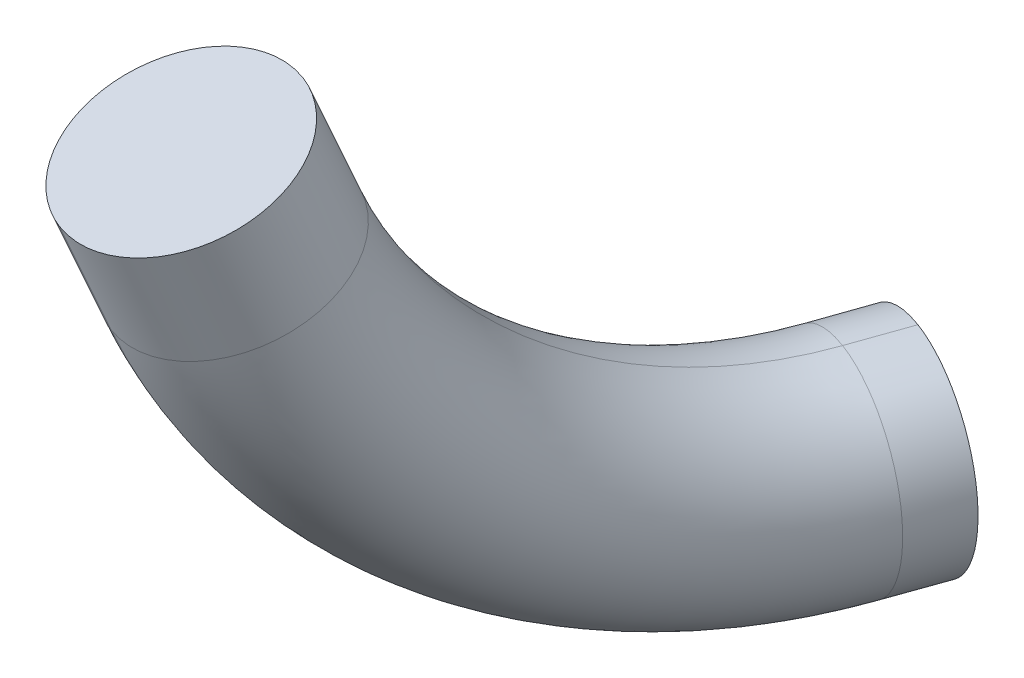
ISO-10303-21;
HEADER;
FILE_DESCRIPTION(('STEP AP214'),'2;1');
FILE_NAME('part.step','',(''),(''),'','','');
FILE_SCHEMA(('AUTOMOTIVE_DESIGN { 1 0 10303 214 1 1 1 1 }'));
ENDSEC;
DATA;
#1=APPLICATION_CONTEXT('core data for automotive mechanical design processes');
#2=APPLICATION_PROTOCOL_DEFINITION('international standard','automotive_design',2000,#1);
#3=PRODUCT_CONTEXT('',#1,'mechanical');
#4=PRODUCT('Part','Part','',(#3));
#5=PRODUCT_RELATED_PRODUCT_CATEGORY('part','',(#4));
#6=PRODUCT_DEFINITION_FORMATION('','',#4);
#7=PRODUCT_DEFINITION_CONTEXT('part definition',#1,'design');
#8=PRODUCT_DEFINITION('design','',#6,#7);
#9=PRODUCT_DEFINITION_SHAPE('','',#8);
#10=(LENGTH_UNIT() NAMED_UNIT(*) SI_UNIT(.MILLI.,.METRE.));
#11=(NAMED_UNIT(*) PLANE_ANGLE_UNIT() SI_UNIT($,.RADIAN.));
#12=(NAMED_UNIT(*) SI_UNIT($,.STERADIAN.) SOLID_ANGLE_UNIT());
#13=UNCERTAINTY_MEASURE_WITH_UNIT(LENGTH_MEASURE(1.E-05),#10,'distance_accuracy_value','');
#14=(GEOMETRIC_REPRESENTATION_CONTEXT(3) GLOBAL_UNCERTAINTY_ASSIGNED_CONTEXT((#13)) GLOBAL_UNIT_ASSIGNED_CONTEXT((#10,
#11,#12)) REPRESENTATION_CONTEXT('',''));
#15=CARTESIAN_POINT('',(0.,0.,0.));
#16=DIRECTION('',(0.,0.,1.));
#17=DIRECTION('',(1.,0.,0.));
#18=AXIS2_PLACEMENT_3D('',#15,#16,#17);
#19=CARTESIAN_POINT('',(165.398911899478,87.6537059481545,-187.091780518201));
#20=DIRECTION('',(-0.127160650574255,0.931699085420016,0.340245474875182));
#21=DIRECTION('',(-0.991871748779087,-0.117874078311736,-0.0479180095170463));
#22=AXIS2_PLACEMENT_3D('',#19,#20,#21);
#23=CIRCLE('',#22,3.);
#24=DIRECTION('',(-0.129094724066351,0.929456224938322,0.345609140709032));
#25=VECTOR('',#24,1.);
#26=SURFACE_OF_LINEAR_EXTRUSION('',#23,#25);
#27=DIRECTION('',(-0.129094724066351,0.929456224938322,0.345609140709032));
#28=VECTOR('',#27,1.);
#29=CARTESIAN_POINT('',(166.186074523711,90.2436129313881,-189.145738097375));
#30=LINE('',#29,#28);
#31=CARTESIAN_POINT('',(166.394446109492,88.7433791435449,-189.703585251367));
#32=VERTEX_POINT('',#31);
#33=CARTESIAN_POINT('',(165.977702938679,91.7438467192157,-188.587890942761));
#34=VERTEX_POINT('',#33);
#35=EDGE_CURVE('E66',#32,#34,#30,.T.);
#36=ORIENTED_EDGE('',*,*,#35,.F.);
#37=CARTESIAN_POINT('',(165.398911903139,87.6537059217969,-187.091780528002));
#38=DIRECTION('',(-0.127160650574255,0.931699085420016,0.340245474875182));
#39=DIRECTION('',(-0.991871748779087,-0.117874078311736,-0.0479180095170463));
#40=AXIS2_PLACEMENT_3D('',#37,#38,#39);
#41=CIRCLE('',#40,3.);
#42=CARTESIAN_POINT('',(164.403377690466,86.5640327528471,-184.479975785037));
#43=VERTEX_POINT('',#42);
#44=EDGE_CURVE('E11',#32,#43,#41,.T.);
#45=ORIENTED_EDGE('',*,*,#44,.T.);
#46=DIRECTION('',(-0.129094724066351,0.929456224938322,0.345609140709032));
#47=VECTOR('',#46,1.);
#48=CARTESIAN_POINT('',(164.195006104686,88.0642665406853,-183.922128630046));
#49=LINE('',#48,#47);
#50=CARTESIAN_POINT('',(163.9866345197,89.5645003283934,-183.364281475804));
#51=VERTEX_POINT('',#50);
#52=EDGE_CURVE('E33',#43,#51,#49,.T.);
#53=ORIENTED_EDGE('',*,*,#52,.T.);
#54=CARTESIAN_POINT('',(165.977702938756,91.7438467191743,-188.587890942618));
#55=CARTESIAN_POINT('',(165.898835809901,91.7440354890763,-188.617883030428));
#56=CARTESIAN_POINT('',(165.818785611349,91.7429253854309,-188.644760545195));
#57=CARTESIAN_POINT('',(165.656896904855,91.738128840954,-188.692129102094));
#58=CARTESIAN_POINT('',(165.575058482722,91.7344425234818,-188.712620449952));
#59=CARTESIAN_POINT('',(165.410221450707,91.7245184643876,-188.74705014355));
#60=CARTESIAN_POINT('',(165.327223696779,91.7182825180335,-188.7609930854));
#61=CARTESIAN_POINT('',(165.16063157154,91.703310050774,-188.782254584841));
#62=CARTESIAN_POINT('',(165.077037207491,91.6945735602549,-188.789573222925));
#63=CARTESIAN_POINT('',(164.826155733128,91.6646838787261,-188.801488333787));
#64=CARTESIAN_POINT('',(164.658700419232,91.6398462521338,-188.796058526605));
#65=CARTESIAN_POINT('',(164.328559739514,91.5810910610425,-188.75855250483));
#66=CARTESIAN_POINT('',(164.165873443561,91.5471752803594,-188.726481522505));
#67=CARTESIAN_POINT('',(163.849734560601,91.4712134148597,-188.636625295629));
#68=CARTESIAN_POINT('',(163.696282177256,91.4291671508048,-188.578839484152));
#69=CARTESIAN_POINT('',(163.402979019557,91.3381338575216,-188.439178506255));
#70=CARTESIAN_POINT('',(163.263130320167,91.2891457722512,-188.357299672578));
#71=CARTESIAN_POINT('',(163.001029088139,91.1856261541123,-188.171786050728));
#72=CARTESIAN_POINT('',(162.878775778992,91.1310948660547,-188.068152223131));
#73=CARTESIAN_POINT('',(162.655338085377,91.0180387530076,-187.842074875086));
#74=CARTESIAN_POINT('',(162.554152353403,90.959514183751,-187.719632558521));
#75=CARTESIAN_POINT('',(162.375709233757,90.8401290439526,-187.459408429425));
#76=CARTESIAN_POINT('',(162.298452336466,90.7792684255662,-187.321626302609));
#77=CARTESIAN_POINT('',(162.17006316232,90.6569359326122,-187.034624628518));
#78=CARTESIAN_POINT('',(162.118931486386,90.5954640440176,-186.885404818248));
#79=CARTESIAN_POINT('',(162.044240849874,90.4736657648104,-186.579797122949));
#80=CARTESIAN_POINT('',(162.020681615949,90.4133393628476,-186.423409308998));
#81=CARTESIAN_POINT('',(162.001827752839,90.2955078289811,-186.107795815894));
#82=CARTESIAN_POINT('',(162.006533033986,90.2380026881278,-185.948570145747));
#83=CARTESIAN_POINT('',(162.03463158546,90.1551581340011,-185.71121437951));
#84=CARTESIAN_POINT('',(162.047516610787,90.1280990821073,-185.632302640522));
#85=CARTESIAN_POINT('',(162.080206071892,90.0752903182222,-185.475478541174));
#86=CARTESIAN_POINT('',(162.100008905013,90.049540304546,-185.397565953668));
#87=CARTESIAN_POINT('',(162.146390678545,89.9995453058122,-185.243329571502));
#88=CARTESIAN_POINT('',(162.172966797469,89.9752996992936,-185.167005129567));
#89=CARTESIAN_POINT('',(162.232723046818,89.9284543622964,-185.016395040782));
#90=CARTESIAN_POINT('',(162.265909525735,89.9058562427615,-184.942111432568));
#91=CARTESIAN_POINT('',(162.374987607971,89.840837230732,-184.723302956215));
#92=CARTESIAN_POINT('',(162.460460440994,89.8011244989978,-184.582613070751));
#93=CARTESIAN_POINT('',(162.65449606098,89.7301629744497,-184.315780769082));
#94=CARTESIAN_POINT('',(162.763057969495,89.6989138597306,-184.189637799703));
#95=CARTESIAN_POINT('',(162.94081140956,89.6590386394156,-184.014014745787));
#96=CARTESIAN_POINT('',(163.002619672815,89.6469043484192,-183.957687510878));
#97=CARTESIAN_POINT('',(163.130752276555,89.6250615949784,-183.849987919374));
#98=CARTESIAN_POINT('',(163.197072903783,89.6153511679209,-183.798611570813));
#99=CARTESIAN_POINT('',(163.333717733639,89.5984265006436,-183.70119795349));
#100=CARTESIAN_POINT('',(163.404037939242,89.5912098175972,-183.655155489317));
#101=CARTESIAN_POINT('',(163.548234347342,89.5793106405462,-183.568680977199));
#102=CARTESIAN_POINT('',(163.622109501326,89.5746274042428,-183.52824728847));
#103=CARTESIAN_POINT('',(163.74462629466,89.5691006963649,-183.467324968108));
#104=CARTESIAN_POINT('',(163.792350048025,89.5674759829206,-183.445040094052));
#105=CARTESIAN_POINT('',(163.888773517758,89.5652344464392,-183.402865518074));
#106=CARTESIAN_POINT('',(163.937471490282,89.5646159616431,-183.382971917463));
#107=CARTESIAN_POINT('',(163.986634519792,89.564500328459,-183.364281475949));
#108=B_SPLINE_CURVE_WITH_KNOTS('',3,(#54,#55,#56,#57,#58,#59,#60,#61,#62,#63,#64,#65,#66,#67,
#68,#69,#70,#71,#72,#73,#74,#75,#76,#77,#78,#79,#80,#81,#82,#83,#84,#85,#86,#87,#88,#89,#90,#91,
#92,#93,#94,#95,#96,#97,#98,#99,#100,#101,#102,#103,#104,#105,#106,#107),.UNSPECIFIED.,.F.,.F.,
(4,2,2,2,2,2,2,2,2,2,2,2,2,2,2,2,2,2,2,2,2,2,2,2,2,2,4),(0.,0.253050577476994,0.506089038735203,
0.758949634262865,1.01180715718079,1.51731058010417,2.02271474672494,2.52813005635787,
3.03362233628287,3.53909230125485,4.0445299258578,4.54997790785142,5.05543751543637,
5.56089211198525,6.0663451050151,6.31933241962662,6.57226116319433,6.82508471821394,
7.07815226220611,7.5836156707436,8.08905985178373,8.34230891304529,8.59535203706144,
8.84814657720097,9.10086700847022,9.2588863367272,9.41664443452902),.UNSPECIFIED.);
#109=EDGE_CURVE('E62',#34,#51,#108,.T.);
#110=ORIENTED_EDGE('',*,*,#109,.F.);
#111=EDGE_LOOP('',(#36,#45,#53,#110));
#112=FACE_BOUND('',#111,.T.);
#113=ADVANCED_FACE('F17',(#112),#26,.T.);
#114=CARTESIAN_POINT('',(166.394446109492,88.7433791435449,-189.703585251367));
#115=CARTESIAN_POINT('',(165.513489350697,88.7454548631521,-190.03851102979));
#116=CARTESIAN_POINT('',(164.509713481903,88.6130975407388,-190.051218315672));
#117=CARTESIAN_POINT('',(163.566202946162,88.3441598968496,-189.667402649562));
#118=CARTESIAN_POINT('',(162.248788534349,87.6611283021772,-188.289407428937));
#119=CARTESIAN_POINT('',(162.31517776306,86.9748361747137,-186.385312024443));
#120=CARTESIAN_POINT('',(162.764283282873,86.702617234187,-185.472045835423));
#121=CARTESIAN_POINT('',(163.52242093167,86.5661084724543,-184.81490156346));
#122=CARTESIAN_POINT('',(164.403377690466,86.5640327528471,-184.479975785037));
#123=B_SPLINE_CURVE_WITH_KNOTS('',5,(#114,#115,#116,#117,#118,#119,#120,#121,#122),
.UNSPECIFIED.,.F.,.F.,(6,3,6),(0.,0.49999999999947,1.),.UNSPECIFIED.);
#124=CARTESIAN_POINT('',(170.127972015936,93.1873805483324,-200.207207915746));
#125=DIRECTION('',(0.940180277421394,0.00391507184373613,0.340654837277103));
#126=AXIS1_PLACEMENT('',#124,#125);
#127=SURFACE_OF_REVOLUTION('',#123,#126);
#128=CARTESIAN_POINT('',(170.253603816736,81.1875885257562,-200.267716763884));
#129=CARTESIAN_POINT('',(170.207456480243,81.1882242325414,-200.284436723732));
#130=CARTESIAN_POINT('',(170.161294718661,81.1876529623984,-200.301162742752));
#131=CARTESIAN_POINT('',(170.069055342379,81.1841005428846,-200.334585954502));
#132=CARTESIAN_POINT('',(170.022977724869,81.1811194755101,-200.351283148194));
#133=CARTESIAN_POINT('',(169.931018816667,81.1727517916469,-200.38460806055));
#134=CARTESIAN_POINT('',(169.885137516109,81.1673652974999,-200.401235782704));
#135=CARTESIAN_POINT('',(169.79368242844,81.1541994630716,-200.43438145737));
#136=CARTESIAN_POINT('',(169.74810862497,81.1464202511146,-200.45089941572));
#137=CARTESIAN_POINT('',(169.657378510995,81.1284876274055,-200.483785701433));
#138=CARTESIAN_POINT('',(169.612222181104,81.1183343264686,-200.500154035743));
#139=CARTESIAN_POINT('',(169.522435607755,81.0956785096661,-200.532701709859));
#140=CARTESIAN_POINT('',(169.4778053466,81.0831760730608,-200.548881056022));
#141=CARTESIAN_POINT('',(169.38917793211,81.0558529483939,-200.581011955812));
#142=CARTESIAN_POINT('',(169.345180767419,81.0410323019625,-200.596963513524));
#143=CARTESIAN_POINT('',(169.25792481281,81.009109544131,-200.628600670041));
#144=CARTESIAN_POINT('',(169.214666021515,80.9920074369847,-200.644286269341));
#145=CARTESIAN_POINT('',(169.1289901442,80.9555641590765,-200.675354040414));
#146=CARTESIAN_POINT('',(169.086573068788,80.9362229601157,-200.690736208363));
#147=CARTESIAN_POINT('',(169.002681836037,80.8953493229607,-200.721160411676));
#148=CARTESIAN_POINT('',(168.961207701389,80.8738168321023,-200.736202438855));
#149=CARTESIAN_POINT('',(168.87930126421,80.8286136645213,-200.765910484862));
#150=CARTESIAN_POINT('',(168.838868994649,80.8049429202425,-200.780576491791));
#151=CARTESIAN_POINT('',(168.75914272186,80.7555213367311,-200.809497516563));
#152=CARTESIAN_POINT('',(168.719848758417,80.7297704249156,-200.823752520041));
#153=CARTESIAN_POINT('',(168.642492870885,80.6762514444123,-200.851817518057));
#154=CARTESIAN_POINT('',(168.604430988712,80.6484833072022,-200.865627497454));
#155=CARTESIAN_POINT('',(168.52963019369,80.5909974719874,-200.89276945435));
#156=CARTESIAN_POINT('',(168.492891319548,80.561279717014,-200.906101417864));
#157=CARTESIAN_POINT('',(168.420824445043,80.4999667120047,-200.932255443177));
#158=CARTESIAN_POINT('',(168.385496474815,80.4683714219015,-200.945077494086));
#159=CARTESIAN_POINT('',(168.316336103928,80.4033796942659,-200.970180954003));
#160=CARTESIAN_POINT('',(168.282503720092,80.3699832364801,-200.982462356929));
#161=CARTESIAN_POINT('',(168.216415825265,80.3014696155723,-201.006455007071));
#162=CARTESIAN_POINT('',(168.184160314273,80.2663524524502,-201.018166254285));
#163=CARTESIAN_POINT('',(168.121303891397,80.1944817700333,-201.04099037254));
#164=CARTESIAN_POINT('',(168.090702960908,80.1577282691469,-201.052103250309));
#165=CARTESIAN_POINT('',(168.031229663238,80.0826729798711,-201.07370376974));
#166=CARTESIAN_POINT('',(168.002357259169,80.0443712245507,-201.084191424744));
#167=CARTESIAN_POINT('',(167.946411031001,79.9663110266403,-201.104516066576));
#168=CARTESIAN_POINT('',(167.919337154349,79.9265526266657,-201.114353072414));
#169=CARTESIAN_POINT('',(167.867053864436,79.8456740827669,-201.133352479117));
#170=CARTESIAN_POINT('',(167.841844387846,79.8045539851652,-201.142514902896));
#171=CARTESIAN_POINT('',(167.793351462515,79.7210501432959,-201.160142771384));
#172=CARTESIAN_POINT('',(167.770067946574,79.6786664431881,-201.168608240411));
#173=CARTESIAN_POINT('',(167.725484002527,79.592736457729,-201.184821455344));
#174=CARTESIAN_POINT('',(167.704183511772,79.5491902091625,-201.192569223923));
#175=CARTESIAN_POINT('',(167.663617988571,79.4610389618227,-201.207327991129));
#176=CARTESIAN_POINT('',(167.644352907208,79.4164339885255,-201.214339007461));
#177=CARTESIAN_POINT('',(167.607905699437,79.3262717092122,-201.227606987478));
#178=CARTESIAN_POINT('',(167.590723546797,79.280714415198,-201.233863960658));
#179=CARTESIAN_POINT('',(167.558484635924,79.1887563027303,-201.245608402378));
#180=CARTESIAN_POINT('',(167.543427881654,79.1423554827042,-201.251095869483));
#181=CARTESIAN_POINT('',(167.515476967614,79.0488213252622,-201.261287743906));
#182=CARTESIAN_POINT('',(167.502582846679,79.0016879747082,-201.265992137161));
#183=CARTESIAN_POINT('',(167.478988979214,78.9068017701094,-201.274606271227));
#184=CARTESIAN_POINT('',(167.468289306726,78.8590488952194,-201.278515985224));
#185=CARTESIAN_POINT('',(167.44911051656,78.7630384703825,-201.285531195713));
#186=CARTESIAN_POINT('',(167.440631502537,78.7147808969867,-201.288636654664));
#187=CARTESIAN_POINT('',(167.425914432373,78.6178775287129,-201.294035882157));
#188=CARTESIAN_POINT('',(167.419676496425,78.5692317131554,-201.296329607165));
#189=CARTESIAN_POINT('',(167.409456032063,78.4716697420713,-201.300100049967));
#190=CARTESIAN_POINT('',(167.40547361837,78.4227535729217,-201.301576726204));
#191=CARTESIAN_POINT('',(167.399772519233,78.3247700408842,-201.303709974462));
#192=CARTESIAN_POINT('',(167.398053910819,78.2757026729084,-201.304366518576));
#193=CARTESIAN_POINT('',(167.396882441863,78.177536782708,-201.304858688021));
#194=CARTESIAN_POINT('',(167.39742958132,78.1284382604834,-201.304694313353));
#195=CARTESIAN_POINT('',(167.400790607927,78.030330123355,-201.303544200151));
#196=CARTESIAN_POINT('',(167.403604417951,77.9813205054829,-201.302558489566));
#197=CARTESIAN_POINT('',(167.41149338668,77.8835095279723,-201.299767578407));
#198=CARTESIAN_POINT('',(167.416568430377,77.8347081578696,-201.29796241951));
#199=CARTESIAN_POINT('',(167.428968245853,77.737431929842,-201.293536740608));
#200=CARTESIAN_POINT('',(167.436292896983,77.6889570545493,-201.290916264328));
#201=CARTESIAN_POINT('',(167.453174276971,77.5924507989488,-201.284866265151));
#202=CARTESIAN_POINT('',(167.462730901648,77.5444193980497,-201.281436780016));
#203=CARTESIAN_POINT('',(167.484052737757,77.448915598264,-201.273777194852));
#204=CARTESIAN_POINT('',(167.495817874675,77.4014431805746,-201.269547121835));
#205=CARTESIAN_POINT('',(167.521527591906,77.3071711843622,-201.260296841789));
#206=CARTESIAN_POINT('',(167.535472133082,77.2603715937731,-201.25527664895));
#207=CARTESIAN_POINT('',(167.565506049655,77.1675572240229,-201.244458591839));
#208=CARTESIAN_POINT('',(167.581595421052,77.1215424433987,-201.238660729018));
#209=CARTESIAN_POINT('',(167.615879108036,77.0304076075777,-201.226301709336));
#210=CARTESIAN_POINT('',(167.634073450133,76.9852875636577,-201.219740542862));
#211=CARTESIAN_POINT('',(167.67252209092,76.8960498640754,-201.205871141802));
#212=CARTESIAN_POINT('',(167.692776439121,76.8519322325359,-201.198562889261));
#213=CARTESIAN_POINT('',(167.735295188666,76.7648045767879,-201.183217324822));
#214=CARTESIAN_POINT('',(167.757559653519,76.7217945876296,-201.17517998989));
#215=CARTESIAN_POINT('',(167.804043997307,76.6369847993142,-201.158395987084));
#216=CARTESIAN_POINT('',(167.828263944474,76.5951850424546,-201.149649294458));
#217=CARTESIAN_POINT('',(167.878600057186,76.5128954720522,-201.131467955621));
#218=CARTESIAN_POINT('',(167.904716287144,76.4724057030754,-201.122033286039));
#219=CARTESIAN_POINT('',(167.958781391011,76.3928328389341,-201.102498961258));
#220=CARTESIAN_POINT('',(167.986730318472,76.3537497849259,-201.092399286627));
#221=CARTESIAN_POINT('',(168.044393041308,76.2770838642798,-201.071559444288));
#222=CARTESIAN_POINT('',(168.074106874346,76.2395010296857,-201.060819262911));
#223=CARTESIAN_POINT('',(168.135227607262,76.1659256496424,-201.038724360355));
#224=CARTESIAN_POINT('',(168.166634526177,76.1299331220839,-201.027369632264));
#225=CARTESIAN_POINT('',(168.231065781001,76.0596248505163,-201.004072986551));
#226=CARTESIAN_POINT('',(168.264090116911,76.0253091065073,-200.992131068928));
#227=CARTESIAN_POINT('',(168.33167688334,75.9584370927937,-200.967688727704));
#228=CARTESIAN_POINT('',(168.366239296556,75.9258808033049,-200.955188310386));
#229=CARTESIAN_POINT('',(168.436819399058,75.862606388865,-200.929658922834));
#230=CARTESIAN_POINT('',(168.472837057262,75.8318882246882,-200.916629963889));
#231=CARTESIAN_POINT('',(168.546241511791,75.7723645532707,-200.890074651751));
#232=CARTESIAN_POINT('',(168.583628268063,75.7435589901443,-200.876548313109));
#233=CARTESIAN_POINT('',(168.659681638622,75.6879306178299,-200.849030541764));
#234=CARTESIAN_POINT('',(168.698348209371,75.6611077412946,-200.835039124882));
#235=CARTESIAN_POINT('',(168.776868964471,75.6095102461813,-200.806624574457));
#236=CARTESIAN_POINT('',(168.816723107318,75.5847355561381,-200.792201456002));
#237=CARTESIAN_POINT('',(168.897523976408,75.5372951477073,-200.762957892503));
#238=CARTESIAN_POINT('',(168.938470668081,75.5146293626922,-200.748137460031));
#239=CARTESIAN_POINT('',(169.021358997999,75.4714624907787,-200.718134606458));
#240=CARTESIAN_POINT('',(169.063300612303,75.4509613518573,-200.702952194066));
#241=CARTESIAN_POINT('',(169.148078723814,75.4121743154859,-200.672261601498));
#242=CARTESIAN_POINT('',(169.190915209742,75.3938883901379,-200.656753425427));
#243=CARTESIAN_POINT('',(169.277380754225,75.3595769452708,-200.625448344059));
#244=CARTESIAN_POINT('',(169.321009814257,75.3435514299664,-200.609651438223));
#245=CARTESIAN_POINT('',(169.408956130644,75.3138003998107,-200.577806688304));
#246=CARTESIAN_POINT('',(169.453273399342,75.3000749262639,-200.561758839719));
#247=CARTESIAN_POINT('',(169.542489871207,75.2749578006753,-200.529450682448));
#248=CARTESIAN_POINT('',(169.587389093954,75.2635662273812,-200.513190366612));
#249=CARTESIAN_POINT('',(169.677661507414,75.2431448018215,-200.480496374705));
#250=CARTESIAN_POINT('',(169.723034720149,75.2341150598018,-200.46406269058));
#251=CARTESIAN_POINT('',(169.814145620333,75.2184389258008,-200.431061619471));
#252=CARTESIAN_POINT('',(169.859883327196,75.2117926616519,-200.414494225365));
#253=CARTESIAN_POINT('',(169.951612381887,75.2008992509608,-200.381265881411));
#254=CARTESIAN_POINT('',(169.997603742497,75.1966522264491,-200.364604926848));
#255=CARTESIAN_POINT('',(170.089728080921,75.1905647884653,-200.331230045979));
#256=CARTESIAN_POINT('',(170.135861063499,75.1887244568856,-200.314516117888));
#257=CARTESIAN_POINT('',(170.182008428068,75.1880911028296,-200.297796146244));
#258=B_SPLINE_CURVE_WITH_KNOTS('',3,(#128,#129,#130,#131,#132,#133,#134,#135,#136,#137,#138,
#139,#140,#141,#142,#143,#144,#145,#146,#147,#148,#149,#150,#151,#152,#153,#154,#155,#156,#157,
#158,#159,#160,#161,#162,#163,#164,#165,#166,#167,#168,#169,#170,#171,#172,#173,#174,#175,#176,
#177,#178,#179,#180,#181,#182,#183,#184,#185,#186,#187,#188,#189,#190,#191,#192,#193,#194,#195,
#196,#197,#198,#199,#200,#201,#202,#203,#204,#205,#206,#207,#208,#209,#210,#211,#212,#213,#214,
#215,#216,#217,#218,#219,#220,#221,#222,#223,#224,#225,#226,#227,#228,#229,#230,#231,#232,#233,
#234,#235,#236,#237,#238,#239,#240,#241,#242,#243,#244,#245,#246,#247,#248,#249,#250,#251,#252,
#253,#254,#255,#256,#257),.UNSPECIFIED.,.F.,.F.,(4,2,2,2,2,2,2,2,2,2,2,2,2,2,2,2,2,2,2,2,2,2,2,
2,2,2,2,2,2,2,2,2,2,2,2,2,2,2,2,2,2,2,2,2,2,2,2,2,2,2,2,2,2,2,2,2,2,2,2,2,2,2,2,2,4),(0.,
0.14724635201027,0.294487693996522,0.441721548038776,0.58894750714245,0.736166595572781,
0.883380717701729,1.03059219646958,1.17780340075594,1.32501645921944,1.47223305656237,
1.6194543067021,1.76668069602605,1.91391208876866,2.06114778558397,2.20838662559836,
2.35562712160683,2.50286761761431,2.65010645762584,2.79734215443588,2.94457354717059,
3.09179993648323,3.23902118660741,3.38623778392984,3.53345084236736,3.68066204662176,
3.82787352535143,3.97508764743596,4.12230673581676,4.26953269486701,4.41676654885436,
4.56400789078721,4.71125424274999,4.85850059471686,5.00574193666081,5.15297579066417,
5.30020174973343,5.44742083813475,5.59463496023951,5.74184643898785,5.88905764325827,
6.03627070170829,6.18348729903915,6.330708549167,6.47793493847842,6.6251663312069,
6.77240202800593,6.91964086800191,7.06688136398968,7.2141218599747,7.3613606999626,
7.50859639674886,7.65582778946077,7.80305417875289,7.95027542886034,8.09749202617124,
8.24470508460357,8.39191628886027,8.53912776760059,8.68634188970447,8.83356097811293,
8.98078693719847,9.1280207912269,9.27526213320425,9.42250848521117),.UNSPECIFIED.);
#259=CARTESIAN_POINT('',(170.253603816732,81.18758852528,-200.26771676389));
#260=VERTEX_POINT('',#259);
#261=CARTESIAN_POINT('',(170.182008428132,75.1880911020489,-200.297796146452));
#262=VERTEX_POINT('',#261);
#263=EDGE_CURVE('E165',#260,#262,#258,.T.);
#264=ORIENTED_EDGE('',*,*,#263,.T.);
#265=CARTESIAN_POINT('',(170.080470478322,93.1871827437726,-200.224419114187));
#266=DIRECTION('',(-0.940180277421394,-0.00391507184373613,-0.340654837277103));
#267=DIRECTION('',(-0.340260237895466,0.0602565524829503,0.938398699056105));
#268=AXIS2_PLACEMENT_3D('',#265,#266,#267);
#269=CIRCLE('',#268,17.9995276069);
#270=EDGE_CURVE('E138',#262,#43,#269,.T.);
#271=ORIENTED_EDGE('',*,*,#270,.T.);
#272=ORIENTED_EDGE('',*,*,#44,.F.);
#273=CARTESIAN_POINT('',(170.175473554549,93.1875783528804,-200.189996718308));
#274=DIRECTION('',(-0.940180277421394,-0.00391507184373613,-0.340654837277103));
#275=DIRECTION('',(-0.340260237895466,0.0602565524829507,0.938398699056105));
#276=AXIS2_PLACEMENT_3D('',#273,#274,#275);
#277=CIRCLE('',#276,12.0004958484);
#278=EDGE_CURVE('E41',#260,#32,#277,.T.);
#279=ORIENTED_EDGE('',*,*,#278,.F.);
#280=EDGE_LOOP('',(#264,#271,#272,#279));
#281=FACE_BOUND('',#280,.T.);
#282=ADVANCED_FACE('F92',(#281),#127,.T.);
#283=CARTESIAN_POINT('',(170.810802691754,78.1996352459061,-201.919515420524));
#284=DIRECTION('',(-0.340654989152248,-0.000648546411300685,0.940188150187628));
#285=DIRECTION('',(-0.940035212875449,0.0182843925228757,-0.340586963262364));
#286=AXIS2_PLACEMENT_3D('',#283,#284,#285);
#287=CIRCLE('',#286,3.);
#288=DIRECTION('',(-0.340624688683062,-0.00677544464166594,0.940174938407462));
#289=VECTOR('',#288,1.);
#290=SURFACE_OF_LINEAR_EXTRUSION('',#287,#289);
#291=DIRECTION('',(-0.340624688683062,-0.00677544464166594,0.940174938407462));
#292=VECTOR('',#291,1.);
#293=CARTESIAN_POINT('',(170.550102102392,81.1934862413614,-201.086096247068));
#294=LINE('',#293,#292);
#295=CARTESIAN_POINT('',(170.846600387027,81.1993839574866,-201.904475729564));
#296=VERTEX_POINT('',#295);
#297=EDGE_CURVE('E70',#296,#260,#294,.T.);
#298=ORIENTED_EDGE('',*,*,#297,.F.);
#299=CARTESIAN_POINT('',(170.84660038707,81.1993839575026,-201.904475729548));
#300=CARTESIAN_POINT('',(170.767276003678,81.2004827591684,-201.933216289972));
#301=CARTESIAN_POINT('',(170.68791255485,81.1980058805811,-201.961973471356));
#302=CARTESIAN_POINT('',(170.52966855476,81.185955611434,-202.019317762796));
#303=CARTESIAN_POINT('',(170.450787980558,81.1763825606653,-202.04790488093));
#304=CARTESIAN_POINT('',(170.294118137755,81.1502040943618,-202.104688559324));
#305=CARTESIAN_POINT('',(170.216328141029,81.133603626745,-202.132885379992));
#306=CARTESIAN_POINT('',(170.062360141264,81.0935065210176,-202.188699710467));
#307=CARTESIAN_POINT('',(169.986182118648,81.0700099667075,-202.216317227311));
#308=CARTESIAN_POINT('',(169.760803053056,80.9893651812278,-202.298033642281));
#309=CARTESIAN_POINT('',(169.614690669863,80.922050678182,-202.351020450167));
#310=CARTESIAN_POINT('',(169.335281166037,80.7623298830179,-202.452368066412));
#311=CARTESIAN_POINT('',(169.201981534743,80.6699285203026,-202.500729781049));
#312=CARTESIAN_POINT('',(168.951838139422,80.4626218917547,-202.591506338457));
#313=CARTESIAN_POINT('',(168.834994738275,80.3477161298071,-202.633921050089));
#314=CARTESIAN_POINT('',(168.621096089265,80.0986513293211,-202.711593983986));
#315=CARTESIAN_POINT('',(168.524043857674,79.9644893613434,-202.746851115398));
#316=CARTESIAN_POINT('',(168.352501415806,79.680738893132,-202.809201203526));
#317=CARTESIAN_POINT('',(168.278010209719,79.5311510741637,-202.836294520582));
#318=CARTESIAN_POINT('',(168.153705055401,79.2208005648768,-202.881547641137));
#319=CARTESIAN_POINT('',(168.103889528605,79.0600385901475,-202.899708016098));
#320=CARTESIAN_POINT('',(168.030340219646,78.7318929243245,-202.926583229038));
#321=CARTESIAN_POINT('',(168.006606971968,78.5645090976065,-202.935297873451));
#322=CARTESIAN_POINT('',(167.985901701869,78.2278632118276,-202.943032159446));
#323=CARTESIAN_POINT('',(167.988930294982,78.0586011096549,-202.942051578032));
#324=CARTESIAN_POINT('',(168.021648951505,77.7230359707079,-202.930428219437));
#325=CARTESIAN_POINT('',(168.051338750597,77.5567329046147,-202.919785538045));
#326=CARTESIAN_POINT('',(168.136592672386,77.2317051996839,-202.889119997063));
#327=CARTESIAN_POINT('',(168.192156712998,77.072980536806,-202.869097167232));
#328=CARTESIAN_POINT('',(168.293603227429,76.8441582626105,-202.832498259447));
#329=CARTESIAN_POINT('',(168.330459135449,76.769392162524,-202.819195964946));
#330=CARTESIAN_POINT('',(168.409958223229,76.6234224940381,-202.790492037146));
#331=CARTESIAN_POINT('',(168.452600061159,76.5522181048569,-202.775090890595));
#332=CARTESIAN_POINT('',(168.543354165731,76.4139129273692,-202.74230368606));
#333=CARTESIAN_POINT('',(168.591464149945,76.3468104447637,-202.724918456228));
#334=CARTESIAN_POINT('',(168.692857291706,76.2170990215016,-202.688270519619));
#335=CARTESIAN_POINT('',(168.74614539685,76.1544944798609,-202.669006017163));
#336=CARTESIAN_POINT('',(168.913109662872,75.9742699080115,-202.608634775278));
#337=CARTESIAN_POINT('',(169.034007989286,75.8640530675023,-202.564906147846));
#338=CARTESIAN_POINT('',(169.291496468254,75.6668071402887,-202.471747335055));
#339=CARTESIAN_POINT('',(169.428086023727,75.5797771716968,-202.422317366643));
#340=CARTESIAN_POINT('',(169.6417483593,75.46843577171,-202.344978665313));
#341=CARTESIAN_POINT('',(169.71451234501,75.434497311625,-202.318637763132));
#342=CARTESIAN_POINT('',(169.862428297,75.3732815755083,-202.265086135445));
#343=CARTESIAN_POINT('',(169.937578273305,75.3459989051725,-202.237876134681));
#344=CARTESIAN_POINT('',(170.089689612659,75.2982926632604,-202.182795088472));
#345=CARTESIAN_POINT('',(170.166649123718,75.2778623797892,-202.154924718682));
#346=CARTESIAN_POINT('',(170.321896707754,75.2439690613279,-202.098697800001));
#347=CARTESIAN_POINT('',(170.400184384638,75.2305039855853,-202.070341396032));
#348=CARTESIAN_POINT('',(170.528038511303,75.2143548731382,-202.024027610143));
#349=CARTESIAN_POINT('',(170.577374407229,75.2095216605049,-202.006155246483));
#350=CARTESIAN_POINT('',(170.676134659302,75.2026294410057,-201.970376554029));
#351=CARTESIAN_POINT('',(170.725558734379,75.2005658611562,-201.952470330229));
#352=CARTESIAN_POINT('',(170.775004997518,75.1998865343069,-201.934555112243));
#353=B_SPLINE_CURVE_WITH_KNOTS('',3,(#299,#300,#301,#302,#303,#304,#305,#306,#307,#308,#309,
#310,#311,#312,#313,#314,#315,#316,#317,#318,#319,#320,#321,#322,#323,#324,#325,#326,#327,#328,
#329,#330,#331,#332,#333,#334,#335,#336,#337,#338,#339,#340,#341,#342,#343,#344,#345,#346,#347,
#348,#349,#350,#351,#352),.UNSPECIFIED.,.F.,.F.,(4,2,2,2,2,2,2,2,2,2,2,2,2,2,2,2,2,2,2,2,2,2,2,
2,2,2,4),(0.,0.253050577477182,0.506089038735573,0.758949634263325,1.01180715718142,
1.51731058010453,2.02271474672515,2.52813005635806,3.03362233628302,3.53909230125502,
4.04452992585806,4.54997790785161,5.05543751543647,5.56089211198541,6.0663451050154,
6.31933241962686,6.57226116319446,6.82508471821403,7.07815226220618,7.58361567074368,
8.08905985178379,8.34230891304513,8.59535203706099,8.84814657720087,9.10086700847067,
9.25888633710467,9.41664443528263),.UNSPECIFIED.);
#354=CARTESIAN_POINT('',(170.775004997476,75.1998865342822,-201.934555112258));
#355=VERTEX_POINT('',#354);
#356=EDGE_CURVE('E130',#296,#355,#353,.T.);
#357=ORIENTED_EDGE('',*,*,#356,.T.);
#358=DIRECTION('',(-0.340624688683062,-0.00677544464166594,0.940174938407462));
#359=VECTOR('',#358,1.);
#360=CARTESIAN_POINT('',(170.478506712792,75.1939888181473,-201.116175629628));
#361=LINE('',#360,#359);
#362=EDGE_CURVE('E139',#355,#262,#361,.T.);
#363=ORIENTED_EDGE('',*,*,#362,.T.);
#364=ORIENTED_EDGE('',*,*,#263,.F.);
#365=EDGE_LOOP('',(#298,#357,#363,#364));
#366=FACE_BOUND('',#365,.T.);
#367=ADVANCED_FACE('F97',(#366),#290,.T.);
#368=CARTESIAN_POINT('',(165.398911899478,87.6537059481545,-187.091780518201));
#369=DIRECTION('',(-0.127160650574255,0.931699085420016,0.340245474875182));
#370=DIRECTION('',(-0.991871748779087,-0.117874078311736,-0.0479180095170463));
#371=AXIS2_PLACEMENT_3D('',#368,#369,#370);
#372=CIRCLE('',#371,3.);
#373=DIRECTION('',(-0.129094724066351,0.929456224938322,0.345609140709032));
#374=VECTOR('',#373,1.);
#375=SURFACE_OF_LINEAR_EXTRUSION('',#372,#374);
#376=ORIENTED_EDGE('',*,*,#52,.F.);
#377=CARTESIAN_POINT('',(165.398911895802,87.653705974618,-187.091780508361));
#378=DIRECTION('',(-0.127160650574255,0.931699085420016,0.340245474875182));
#379=DIRECTION('',(-0.991871748779087,-0.117874078311736,-0.0479180095170463));
#380=AXIS2_PLACEMENT_3D('',#377,#378,#379);
#381=CIRCLE('',#380,3.);
#382=EDGE_CURVE('E74',#43,#32,#381,.T.);
#383=ORIENTED_EDGE('',*,*,#382,.T.);
#384=ORIENTED_EDGE('',*,*,#35,.T.);
#385=CARTESIAN_POINT('',(163.986634519792,89.564500328459,-183.364281475949));
#386=CARTESIAN_POINT('',(164.065501648647,89.564311558557,-183.33428938814));
#387=CARTESIAN_POINT('',(164.145551847199,89.5654216622025,-183.307411873373));
#388=CARTESIAN_POINT('',(164.307440553693,89.5702182066795,-183.260043316475));
#389=CARTESIAN_POINT('',(164.389278975826,89.5739045241518,-183.239551968617));
#390=CARTESIAN_POINT('',(164.554116007841,89.5838285832462,-183.205122275019));
#391=CARTESIAN_POINT('',(164.637113761769,89.5900645296003,-183.19117933317));
#392=CARTESIAN_POINT('',(164.803705887008,89.6050369968601,-183.169917833729));
#393=CARTESIAN_POINT('',(164.887300251057,89.6137734873792,-183.162599195645));
#394=CARTESIAN_POINT('',(165.138181725421,89.6436631689083,-183.150684084784));
#395=CARTESIAN_POINT('',(165.305637039316,89.6685007955006,-183.156113891966));
#396=CARTESIAN_POINT('',(165.635777719035,89.7272559865923,-183.193619913742));
#397=CARTESIAN_POINT('',(165.798464014988,89.7611717672756,-183.225690896067));
#398=CARTESIAN_POINT('',(166.114602897947,89.8371336327756,-183.315547122944));
#399=CARTESIAN_POINT('',(166.268055281291,89.8791798968305,-183.373332934422));
#400=CARTESIAN_POINT('',(166.56135843899,89.970213190114,-183.51299391232));
#401=CARTESIAN_POINT('',(166.701207138381,90.0192012753845,-183.594872745997));
#402=CARTESIAN_POINT('',(166.963308370407,90.1227208935236,-183.780386367847));
#403=CARTESIAN_POINT('',(167.085561679554,90.1772521815812,-183.884020195445));
#404=CARTESIAN_POINT('',(167.308999373169,90.2903082946284,-184.110097543491));
#405=CARTESIAN_POINT('',(167.410185105143,90.3488328638852,-184.232539860055));
#406=CARTESIAN_POINT('',(167.588628224787,90.4682180036836,-184.492763989152));
#407=CARTESIAN_POINT('',(167.665885122078,90.5290786220699,-184.630546115968));
#408=CARTESIAN_POINT('',(167.794274296224,90.6514111150239,-184.91754779006));
#409=CARTESIAN_POINT('',(167.845405972157,90.7128830036187,-185.06676760033));
#410=CARTESIAN_POINT('',(167.920096608668,90.8346812828258,-185.372375295629));
#411=CARTESIAN_POINT('',(167.943655842592,90.8950076847885,-185.52876310958));
#412=CARTESIAN_POINT('',(167.962509705702,91.0128392186549,-185.844376602684));
#413=CARTESIAN_POINT('',(167.957804424554,91.0703443595083,-186.003602272832));
#414=CARTESIAN_POINT('',(167.929705873079,91.1531889136349,-186.240958039069));
#415=CARTESIAN_POINT('',(167.916820847752,91.1802479655286,-186.319869778056));
#416=CARTESIAN_POINT('',(167.884131386647,91.2330567294135,-186.476693877405));
#417=CARTESIAN_POINT('',(167.864328553525,91.2588067430897,-186.55460646491));
#418=CARTESIAN_POINT('',(167.817946779993,91.3088017418235,-186.708842847076));
#419=CARTESIAN_POINT('',(167.791370661069,91.3330473483419,-186.785167289011));
#420=CARTESIAN_POINT('',(167.73161441172,91.3798926853391,-186.935777377796));
#421=CARTESIAN_POINT('',(167.698427932802,91.4024908048738,-187.01006098601));
#422=CARTESIAN_POINT('',(167.589349850565,91.4675098169031,-187.228869462363));
#423=CARTESIAN_POINT('',(167.503877017543,91.5072225486373,-187.369559347826));
#424=CARTESIAN_POINT('',(167.309841397555,91.5781840731852,-187.636391649495));
#425=CARTESIAN_POINT('',(167.20127948904,91.6094331879042,-187.762534618873));
#426=CARTESIAN_POINT('',(167.023526048975,91.6493084082189,-187.93815767279));
#427=CARTESIAN_POINT('',(166.96171778572,91.6614426992152,-187.994484907698));
#428=CARTESIAN_POINT('',(166.833585181979,91.6832854526559,-188.102184499202));
#429=CARTESIAN_POINT('',(166.767264554751,91.6929958797132,-188.153560847762));
#430=CARTESIAN_POINT('',(166.630619724894,91.7099205469904,-188.250974465085));
#431=CARTESIAN_POINT('',(166.560299519292,91.7171372300367,-188.297016929258));
#432=CARTESIAN_POINT('',(166.416103111191,91.7290364070876,-188.383491441376));
#433=CARTESIAN_POINT('',(166.342227957207,91.7337196433909,-188.423925130104));
#434=CARTESIAN_POINT('',(166.219711163875,91.7392463512685,-188.484847450464));
#435=CARTESIAN_POINT('',(166.171987410513,91.7408710647127,-188.50713232452));
#436=CARTESIAN_POINT('',(166.075563940785,91.743112601194,-188.549306900496));
#437=CARTESIAN_POINT('',(166.026865968264,91.7437310859901,-188.569200501105));
#438=CARTESIAN_POINT('',(165.977702938756,91.7438467191742,-188.587890942618));
#439=B_SPLINE_CURVE_WITH_KNOTS('',3,(#385,#386,#387,#388,#389,#390,#391,#392,#393,#394,#395,
#396,#397,#398,#399,#400,#401,#402,#403,#404,#405,#406,#407,#408,#409,#410,#411,#412,#413,#414,
#415,#416,#417,#418,#419,#420,#421,#422,#423,#424,#425,#426,#427,#428,#429,#430,#431,#432,#433,
#434,#435,#436,#437,#438),.UNSPECIFIED.,.F.,.F.,(4,2,2,2,2,2,2,2,2,2,2,2,2,2,2,2,2,2,2,2,2,2,2,
2,2,2,4),(0.,0.253050577476985,0.506089038735152,0.758949634262811,1.0118071571807,
1.51731058010404,2.02271474672482,2.52813005635784,3.03362233628287,3.53909230125492,
4.04452992585793,4.54997790785138,5.05543751543619,5.56089211198521,6.06634510501523,
6.31933241962677,6.57226116319443,6.82508471821404,7.07815226220624,7.58361567074375,
8.089059851784,8.3423089130455,8.59535203706158,8.84814657720101,9.10086700847021,
9.25888633671901,9.41664443451264),.UNSPECIFIED.);
#440=EDGE_CURVE('E22',#51,#34,#439,.T.);
#441=ORIENTED_EDGE('',*,*,#440,.F.);
#442=EDGE_LOOP('',(#376,#383,#384,#441));
#443=FACE_BOUND('',#442,.T.);
#444=ADVANCED_FACE('F73',(#443),#375,.T.);
#445=CARTESIAN_POINT('',(164.403377690466,86.5640327528471,-184.479975785037));
#446=CARTESIAN_POINT('',(165.284334448262,86.5619570331519,-184.145050005614));
#447=CARTESIAN_POINT('',(166.288110317054,86.6943143555702,-184.132342720731));
#448=CARTESIAN_POINT('',(167.231620852796,86.9632519994543,-184.516158385841));
#449=CARTESIAN_POINT('',(168.549035264606,87.6462835941318,-185.894153607466));
#450=CARTESIAN_POINT('',(168.482646036898,88.3325757215733,-187.798249010962));
#451=CARTESIAN_POINT('',(168.033540516086,88.604794662217,-188.711515199979));
#452=CARTESIAN_POINT('',(167.275402867288,88.7413034239547,-189.368659472943));
#453=CARTESIAN_POINT('',(166.376826974336,88.7434206579367,-189.710283766936));
#454=CARTESIAN_POINT('',(166.359207839179,88.7434621723285,-189.716982282504));
#455=CARTESIAN_POINT('',(166.341588704024,88.7435036867203,-189.723680798073));
#456=CARTESIAN_POINT('',(166.323969568867,88.7435452011122,-189.730379313641));
#457=CARTESIAN_POINT('',(166.306350433711,88.7435867155039,-189.73707782921));
#458=B_SPLINE_CURVE_WITH_KNOTS('',5,(#445,#446,#447,#448,#449,#450,#451,#452,#453,#454,#455,
#456,#457),.UNSPECIFIED.,.F.,.F.,(6,3,4,6),(0.,0.495049504957324,0.99009900990099,1.),.UNSPECIFIED.);
#459=CARTESIAN_POINT('',(170.127972015936,93.1873805483324,-200.207207915746));
#460=DIRECTION('',(0.940180277421394,0.00391507184373613,0.340654837277103));
#461=AXIS1_PLACEMENT('',#459,#460);
#462=SURFACE_OF_REVOLUTION('',#458,#461);
#463=CARTESIAN_POINT('',(170.182008428141,75.1880911028286,-200.297796146206));
#464=CARTESIAN_POINT('',(170.2281557646,75.1874553959685,-200.281076186349));
#465=CARTESIAN_POINT('',(170.274317526152,75.1880266660436,-200.264350167321));
#466=CARTESIAN_POINT('',(170.366556902375,75.1915790854334,-200.230926955559));
#467=CARTESIAN_POINT('',(170.412634519857,75.1945601527518,-200.214229761862));
#468=CARTESIAN_POINT('',(170.504593428007,75.2029278365127,-200.180904849499));
#469=CARTESIAN_POINT('',(170.550474728541,75.2083143306136,-200.164277127342));
#470=CARTESIAN_POINT('',(170.641929816166,75.2214801649576,-200.131131452672));
#471=CARTESIAN_POINT('',(170.687503619614,75.2292593768766,-200.114613494321));
#472=CARTESIAN_POINT('',(170.778233733552,75.247192000516,-200.081727208607));
#473=CARTESIAN_POINT('',(170.823390063425,75.2573453014215,-200.065358874298));
#474=CARTESIAN_POINT('',(170.913176636742,75.2800011181662,-200.032811200182));
#475=CARTESIAN_POINT('',(170.957806897882,75.2925035547454,-200.016631854019));
#476=CARTESIAN_POINT('',(171.046434312346,75.3198266793643,-199.98450095423));
#477=CARTESIAN_POINT('',(171.090431477025,75.3346473257738,-199.968549396519));
#478=CARTESIAN_POINT('',(171.177687431613,75.366570083565,-199.936912240004));
#479=CARTESIAN_POINT('',(171.220946222899,75.3836721906927,-199.921226640704));
#480=CARTESIAN_POINT('',(171.306622100199,75.4201154685663,-199.890158869632));
#481=CARTESIAN_POINT('',(171.349039175604,75.4394566675113,-199.874776701683));
#482=CARTESIAN_POINT('',(171.432930408344,75.4803303046362,-199.84435249837));
#483=CARTESIAN_POINT('',(171.474404542988,75.5018627954806,-199.829310471191));
#484=CARTESIAN_POINT('',(171.55631098016,75.5470659630352,-199.799602425183));
#485=CARTESIAN_POINT('',(171.59674324972,75.5707367073015,-199.784936418254));
#486=CARTESIAN_POINT('',(171.676469522506,75.6201582907892,-199.75601539348));
#487=CARTESIAN_POINT('',(171.715763485949,75.6459092025936,-199.74176039));
#488=CARTESIAN_POINT('',(171.793119373482,75.6994281830754,-199.713695391981));
#489=CARTESIAN_POINT('',(171.831181255657,75.7271963202753,-199.699885412582));
#490=CARTESIAN_POINT('',(171.905982050684,75.7846821554705,-199.672743455682));
#491=CARTESIAN_POINT('',(171.942720924829,75.8143999104344,-199.659411492166));
#492=CARTESIAN_POINT('',(172.014787799342,75.8757129154256,-199.633257466847));
#493=CARTESIAN_POINT('',(172.050115769574,75.9073082055204,-199.620435415936));
#494=CARTESIAN_POINT('',(172.119276140472,75.9722999331396,-199.595331956013));
#495=CARTESIAN_POINT('',(172.153108524313,76.0056963909176,-199.583050553083));
#496=CARTESIAN_POINT('',(172.219196419152,76.0742100118107,-199.559057902935));
#497=CARTESIAN_POINT('',(172.251451930151,76.109327174926,-199.547346655716));
#498=CARTESIAN_POINT('',(172.314308353041,76.18119785733,-199.524522537454));
#499=CARTESIAN_POINT('',(172.344909283537,76.2179513582106,-199.513409659682));
#500=CARTESIAN_POINT('',(172.404382581224,76.2930066474758,-199.491809140243));
#501=CARTESIAN_POINT('',(172.433254985301,76.3313084027915,-199.481321485235));
#502=CARTESIAN_POINT('',(172.489201213486,76.4093686006937,-199.460996843396));
#503=CARTESIAN_POINT('',(172.516275090147,76.4491270006648,-199.451159837554));
#504=CARTESIAN_POINT('',(172.568558380077,76.5300055445582,-199.432160430844));
#505=CARTESIAN_POINT('',(172.593767856676,76.5711256421579,-199.422998007061));
#506=CARTESIAN_POINT('',(172.642260782026,76.6546294840248,-199.405370138566));
#507=CARTESIAN_POINT('',(172.665544297977,76.6970131841322,-199.396904669536));
#508=CARTESIAN_POINT('',(172.710128242044,76.7829431695921,-199.380691454597));
#509=CARTESIAN_POINT('',(172.73142873281,76.8264894181598,-199.372943686015));
#510=CARTESIAN_POINT('',(172.771994256031,76.9146406655038,-199.358184918803));
#511=CARTESIAN_POINT('',(172.791259337404,76.9592456388039,-199.351173902468));
#512=CARTESIAN_POINT('',(172.827706545196,77.0494079181248,-199.337905922447));
#513=CARTESIAN_POINT('',(172.844888697847,77.0949652121436,-199.331648949265));
#514=CARTESIAN_POINT('',(172.877127608742,77.1869233246223,-199.319904507541));
#515=CARTESIAN_POINT('',(172.892184363022,77.2333241446547,-199.314417040434));
#516=CARTESIAN_POINT('',(172.920135277086,77.3268583021107,-199.304225166007));
#517=CARTESIAN_POINT('',(172.933029398032,77.3739916526726,-199.299520772751));
#518=CARTESIAN_POINT('',(172.956623265521,77.468877857288,-199.290906638682));
#519=CARTESIAN_POINT('',(172.967322938021,77.5166307321871,-199.286996924683));
#520=CARTESIAN_POINT('',(172.986501728212,77.6126411570427,-199.279981714191));
#521=CARTESIAN_POINT('',(172.994980742248,77.6608987304483,-199.276876255239));
#522=CARTESIAN_POINT('',(173.009697812439,77.7578020987421,-199.271477027742));
#523=CARTESIAN_POINT('',(173.0159357484,77.8064479143097,-199.269183302733));
#524=CARTESIAN_POINT('',(173.026156212791,77.9040098854138,-199.265412859927));
#525=CARTESIAN_POINT('',(173.0301386265,77.9529260545732,-199.263936183687));
#526=CARTESIAN_POINT('',(173.035839725669,78.0509095866293,-199.261802935423));
#527=CARTESIAN_POINT('',(173.037558334098,78.0999769546138,-199.261146391306));
#528=CARTESIAN_POINT('',(173.038729803089,78.1981428448298,-199.260654221852));
#529=CARTESIAN_POINT('',(173.038182663651,78.2472413670613,-199.260818596516));
#530=CARTESIAN_POINT('',(173.034821637081,78.3453495042018,-199.261968709705));
#531=CARTESIAN_POINT('',(173.032007827077,78.394359122079,-199.262954420285));
#532=CARTESIAN_POINT('',(173.024118858386,78.4921700995982,-199.26574533143));
#533=CARTESIAN_POINT('',(173.019043814708,78.5409714697045,-199.267550490319));
#534=CARTESIAN_POINT('',(173.006643999269,78.6382476977379,-199.271976169207));
#535=CARTESIAN_POINT('',(172.999319348157,78.6867225730328,-199.27459664548));
#536=CARTESIAN_POINT('',(172.982437968203,78.7832288286367,-199.280646644642));
#537=CARTESIAN_POINT('',(172.972881343543,78.8312602295369,-199.284076129769));
#538=CARTESIAN_POINT('',(172.951559507464,78.926764029324,-199.291735714917));
#539=CARTESIAN_POINT('',(172.939794370561,78.9742364470137,-199.295965787927));
#540=CARTESIAN_POINT('',(172.914084653356,79.0685084432263,-199.305216067958));
#541=CARTESIAN_POINT('',(172.900140112192,79.1153080338153,-199.31023626079));
#542=CARTESIAN_POINT('',(172.870106195639,79.2081224035649,-199.321054317887));
#543=CARTESIAN_POINT('',(172.854016824251,79.2541371841887,-199.326852180702));
#544=CARTESIAN_POINT('',(172.819733137282,79.3452720200089,-199.339211200372));
#545=CARTESIAN_POINT('',(172.801538795191,79.3903920639287,-199.345772366839));
#546=CARTESIAN_POINT('',(172.763090154413,79.4796297635106,-199.359641767889));
#547=CARTESIAN_POINT('',(172.742835806215,79.5237473950502,-199.366950020426));
#548=CARTESIAN_POINT('',(172.700317056673,79.6108750507988,-199.382295584856));
#549=CARTESIAN_POINT('',(172.67805259182,79.6538850399577,-199.390332919784));
#550=CARTESIAN_POINT('',(172.631568248029,79.7386948282753,-199.407116922584));
#551=CARTESIAN_POINT('',(172.60734830086,79.7804945851363,-199.415863615207));
#552=CARTESIAN_POINT('',(172.55701218814,79.8627841555429,-199.434044954041));
#553=CARTESIAN_POINT('',(172.530895958176,79.9032739245223,-199.443479623622));
#554=CARTESIAN_POINT('',(172.476830854296,79.9828467886704,-199.463013948402));
#555=CARTESIAN_POINT('',(172.448881926827,80.0219298426826,-199.473113623033));
#556=CARTESIAN_POINT('',(172.391219203975,80.0985957633383,-199.493953465373));
#557=CARTESIAN_POINT('',(172.361505370926,80.1361785979379,-199.504693646751));
#558=CARTESIAN_POINT('',(172.30038463799,80.2097539779941,-199.526788549312));
#559=CARTESIAN_POINT('',(172.268977719064,80.2457465055599,-199.538143277405));
#560=CARTESIAN_POINT('',(172.204546464216,80.3160547771438,-199.561439923125));
#561=CARTESIAN_POINT('',(172.171522128294,80.3503705211619,-199.573381840752));
#562=CARTESIAN_POINT('',(172.10393536184,80.4172425348958,-199.597824181984));
#563=CARTESIAN_POINT('',(172.069372948611,80.4497988243958,-199.610324599307));
#564=CARTESIAN_POINT('',(171.998792846083,80.51307323886,-199.63585398687));
#565=CARTESIAN_POINT('',(171.962775187867,80.5437914030498,-199.648882945821));
#566=CARTESIAN_POINT('',(171.889370733312,80.6033150744957,-199.675438257972));
#567=CARTESIAN_POINT('',(171.851983977028,80.6321206376372,-199.688964596621));
#568=CARTESIAN_POINT('',(171.775930606446,80.6877490099839,-199.716482367981));
#569=CARTESIAN_POINT('',(171.737264035686,80.7145718865364,-199.730473784871));
#570=CARTESIAN_POINT('',(171.658743280566,80.7661693816859,-199.758888335311));
#571=CARTESIAN_POINT('',(171.618889137709,80.7909440717482,-199.773311453775));
#572=CARTESIAN_POINT('',(171.538088268603,80.8383844802188,-199.80255501729));
#573=CARTESIAN_POINT('',(171.497141576923,80.8610502652548,-199.81737544977));
#574=CARTESIAN_POINT('',(171.414253246994,80.9042171372112,-199.84737830336));
#575=CARTESIAN_POINT('',(171.372311632686,80.924718276155,-199.86256071576));
#576=CARTESIAN_POINT('',(171.287533521172,80.9635053125722,-199.893251308344));
#577=CARTESIAN_POINT('',(171.244697035243,80.9817912379439,-199.908759484423));
#578=CARTESIAN_POINT('',(171.158231490764,81.0161026828588,-199.940064565807));
#579=CARTESIAN_POINT('',(171.114602430737,81.0321281981876,-199.955861471649));
#580=CARTESIAN_POINT('',(171.026656114362,81.0618792283924,-199.987706221582));
#581=CARTESIAN_POINT('',(170.982338845672,81.0756047019642,-200.003754070172));
#582=CARTESIAN_POINT('',(170.893122373831,81.1007218276022,-200.036062227455));
#583=CARTESIAN_POINT('',(170.848223151098,81.1121134009211,-200.052322543296));
#584=CARTESIAN_POINT('',(170.757950737673,81.1325348265294,-200.085016535209));
#585=CARTESIAN_POINT('',(170.712577524958,81.1415645685732,-200.101450219338));
#586=CARTESIAN_POINT('',(170.621466624821,81.1572407026206,-200.13445129045));
#587=CARTESIAN_POINT('',(170.575728917984,81.1638869667922,-200.151018684556));
#588=CARTESIAN_POINT('',(170.483999863352,81.1747803775261,-200.184247028507));
#589=CARTESIAN_POINT('',(170.438008502775,81.1790274020584,-200.200907983067));
#590=CARTESIAN_POINT('',(170.345884164426,81.1851148400796,-200.234282863929));
#591=CARTESIAN_POINT('',(170.299751181888,81.1869551716766,-200.250996792013));
#592=CARTESIAN_POINT('',(170.253603817359,81.1875885257478,-200.26771676365));
#593=B_SPLINE_CURVE_WITH_KNOTS('',3,(#463,#464,#465,#466,#467,#468,#469,#470,#471,#472,#473,
#474,#475,#476,#477,#478,#479,#480,#481,#482,#483,#484,#485,#486,#487,#488,#489,#490,#491,#492,
#493,#494,#495,#496,#497,#498,#499,#500,#501,#502,#503,#504,#505,#506,#507,#508,#509,#510,#511,
#512,#513,#514,#515,#516,#517,#518,#519,#520,#521,#522,#523,#524,#525,#526,#527,#528,#529,#530,
#531,#532,#533,#534,#535,#536,#537,#538,#539,#540,#541,#542,#543,#544,#545,#546,#547,#548,#549,
#550,#551,#552,#553,#554,#555,#556,#557,#558,#559,#560,#561,#562,#563,#564,#565,#566,#567,#568,
#569,#570,#571,#572,#573,#574,#575,#576,#577,#578,#579,#580,#581,#582,#583,#584,#585,#586,#587,
#588,#589,#590,#591,#592),.UNSPECIFIED.,.F.,.F.,(4,2,2,2,2,2,2,2,2,2,2,2,2,2,2,2,2,2,2,2,2,2,2,
2,2,2,2,2,2,2,2,2,2,2,2,2,2,2,2,2,2,2,2,2,2,2,2,2,2,2,2,2,2,2,2,2,2,2,2,2,2,2,2,2,4),(0.,
0.147246351927563,0.294487693830388,0.441721547792101,0.588947506820417,0.736166595182267,
0.883380717250658,1.03059219596647,1.17780340020881,1.32501645863612,1.47223305595002,
1.61945430606711,1.76668069537418,1.91391208810476,2.06114778491189,2.20838662492168,
2.35562712092846,2.50286761693681,2.65010645695173,2.79734215376767,2.94457354651083,
3.09179993583469,3.23902118597324,3.38623778331341,3.53345084177229,3.68066204605171,
3.82787352481007,3.97508764692654,4.12230673534181,4.26953269442805,4.41676654845109,
4.56400789041741,4.71125424240828,4.85850059439538,5.00574193635096,5.15297579035817,
5.30020174942471,5.44742083781802,5.59463495991137,5.74184643864695,5.88905764290501,
6.036270701345,6.18348729866993,6.33070854879745,6.4779349381154,6.62516633085827,
6.77240202767997,6.91964086770709,7.06688136373421,7.21412185976597,7.3613606998069,
7.50859639665091,7.6558277894233,7.80305417877642,7.95027542894257,8.09749202630715,
8.24470508478516,8.39191628907631,8.53912776783687,8.68634188994367,8.83356097833495,
8.98078693738065,9.12802079134453,9.27526213323085,9.42250848511949),.UNSPECIFIED.);
#594=EDGE_CURVE('E76',#262,#260,#593,.T.);
#595=ORIENTED_EDGE('',*,*,#594,.T.);
#596=ORIENTED_EDGE('',*,*,#278,.T.);
#597=ORIENTED_EDGE('',*,*,#382,.F.);
#598=ORIENTED_EDGE('',*,*,#270,.F.);
#599=EDGE_LOOP('',(#595,#596,#597,#598));
#600=FACE_BOUND('',#599,.T.);
#601=ADVANCED_FACE('F87',(#600),#462,.T.);
#602=CARTESIAN_POINT('',(170.810802691754,78.1996352459061,-201.919515420524));
#603=DIRECTION('',(-0.340654989152248,-0.000648546411300685,0.940188150187628));
#604=DIRECTION('',(-0.940035212875449,0.0182843925228757,-0.340586963262364));
#605=AXIS2_PLACEMENT_3D('',#602,#603,#604);
#606=CIRCLE('',#605,3.);
#607=DIRECTION('',(-0.340624688683062,-0.00677544464166594,0.940174938407462));
#608=VECTOR('',#607,1.);
#609=SURFACE_OF_LINEAR_EXTRUSION('',#606,#608);
#610=ORIENTED_EDGE('',*,*,#362,.F.);
#611=CARTESIAN_POINT('',(170.775004997518,75.1998865343069,-201.934555112243));
#612=CARTESIAN_POINT('',(170.85432938091,75.1987877326626,-201.905814551819));
#613=CARTESIAN_POINT('',(170.933692829737,75.2012646112714,-201.877057370436));
#614=CARTESIAN_POINT('',(171.091936829824,75.2133148804612,-201.819713078996));
#615=CARTESIAN_POINT('',(171.170817404025,75.2228879312512,-201.791125960864));
#616=CARTESIAN_POINT('',(171.327487246821,75.249066397597,-201.734342282471));
#617=CARTESIAN_POINT('',(171.405277243543,75.2656668652347,-201.706145461805));
#618=CARTESIAN_POINT('',(171.559245243298,75.3057639710037,-201.650331131333));
#619=CARTESIAN_POINT('',(171.635423265909,75.3292605253344,-201.622713614491));
#620=CARTESIAN_POINT('',(171.860802331481,75.4099053108752,-201.540997199528));
#621=CARTESIAN_POINT('',(172.006914714658,75.4772198139604,-201.488010391648));
#622=CARTESIAN_POINT('',(172.286324218446,75.6369406091999,-201.386662775417));
#623=CARTESIAN_POINT('',(172.419623849718,75.7293419719511,-201.338301060788));
#624=CARTESIAN_POINT('',(172.66976724499,75.9366486005667,-201.247524503398));
#625=CARTESIAN_POINT('',(172.786610646109,76.0515543625459,-201.205109791776));
#626=CARTESIAN_POINT('',(173.00050929506,76.3006191630898,-201.1274368579));
#627=CARTESIAN_POINT('',(173.097561526619,76.4347811310936,-201.0921797265));
#628=CARTESIAN_POINT('',(173.269103968419,76.7185315993514,-201.029829638396));
#629=CARTESIAN_POINT('',(173.343595174471,76.8681194183399,-201.002736321353));
#630=CARTESIAN_POINT('',(173.467900328714,77.1784699276605,-200.957483200826));
#631=CARTESIAN_POINT('',(173.517715855472,77.3392319024031,-200.939322825878));
#632=CARTESIAN_POINT('',(173.591265164353,77.667377568246,-200.912447612967));
#633=CARTESIAN_POINT('',(173.61499841199,77.8347613949704,-200.903732968568));
#634=CARTESIAN_POINT('',(173.635703682009,78.171407280755,-200.895998682602));
#635=CARTESIAN_POINT('',(173.632675088855,78.340669382927,-200.89697926403));
#636=CARTESIAN_POINT('',(173.599956432252,78.6762345218651,-200.908602622654));
#637=CARTESIAN_POINT('',(173.57026663312,78.8425375879502,-200.919245304061));
#638=CARTESIAN_POINT('',(173.485012711254,79.167565292858,-200.949910845071));
#639=CARTESIAN_POINT('',(173.429448670605,79.3262899557209,-200.969933674917));
#640=CARTESIAN_POINT('',(173.328002156118,79.555112229889,-201.006532582721));
#641=CARTESIAN_POINT('',(173.291146248081,79.6298783299655,-201.019834877229));
#642=CARTESIAN_POINT('',(173.211647160266,79.77584799843,-201.048538805041));
#643=CARTESIAN_POINT('',(173.169005322319,79.8470523875996,-201.063939951598));
#644=CARTESIAN_POINT('',(173.078251217714,79.9853575650629,-201.096727156145));
#645=CARTESIAN_POINT('',(173.030141233483,80.0524600476555,-201.114112385983));
#646=CARTESIAN_POINT('',(172.928748091692,80.1821714708901,-201.150760322603));
#647=CARTESIAN_POINT('',(172.875459986533,80.2447760125164,-201.170024825065));
#648=CARTESIAN_POINT('',(172.708495720467,80.4250005843206,-201.230396066965));
#649=CARTESIAN_POINT('',(172.587597394028,80.5352174247973,-201.274124694407));
#650=CARTESIAN_POINT('',(172.330108915013,80.7324633519414,-201.367283507215));
#651=CARTESIAN_POINT('',(172.193519359519,80.8194933204964,-201.416713475634));
#652=CARTESIAN_POINT('',(171.979857023919,80.9308347204256,-201.494052176974));
#653=CARTESIAN_POINT('',(171.907093038201,80.9647731804909,-201.520393079158));
#654=CARTESIAN_POINT('',(171.759177086196,81.0259889165678,-201.573944706851));
#655=CARTESIAN_POINT('',(171.684027109884,81.0532715868834,-201.601154707617));
#656=CARTESIAN_POINT('',(171.531915770519,81.1009778287543,-201.65623575383));
#657=CARTESIAN_POINT('',(171.454956259455,81.1214081122046,-201.684106123622));
#658=CARTESIAN_POINT('',(171.299708675411,81.1553014306239,-201.740333042306));
#659=CARTESIAN_POINT('',(171.221420998524,81.1687665063453,-201.768689446276));
#660=CARTESIAN_POINT('',(171.093566872093,81.1849156187278,-201.81500323208));
#661=CARTESIAN_POINT('',(171.044230976405,81.1897488313311,-201.832875595654));
#662=CARTESIAN_POINT('',(170.945470724808,81.196641050797,-201.868654287935));
#663=CARTESIAN_POINT('',(170.89604664997,81.1987046306432,-201.886560511649));
#664=CARTESIAN_POINT('',(170.84660038707,81.1993839575026,-201.904475729548));
#665=B_SPLINE_CURVE_WITH_KNOTS('',3,(#611,#612,#613,#614,#615,#616,#617,#618,#619,#620,#621,
#622,#623,#624,#625,#626,#627,#628,#629,#630,#631,#632,#633,#634,#635,#636,#637,#638,#639,#640,
#641,#642,#643,#644,#645,#646,#647,#648,#649,#650,#651,#652,#653,#654,#655,#656,#657,#658,#659,
#660,#661,#662,#663,#664),.UNSPECIFIED.,.F.,.F.,(4,2,2,2,2,2,2,2,2,2,2,2,2,2,2,2,2,2,2,2,2,2,2,
2,2,2,4),(0.,0.253050577476988,0.506089038735202,0.758949634262846,1.01180715718077,
1.5173105801041,2.02271474672487,2.52813005635784,3.03362233628286,3.53909230125494,
4.04452992585799,4.54997790785151,5.05543751543637,5.56089211198524,6.06634510501516,
6.31933241962667,6.57226116319434,6.82508471821394,7.07815226220609,7.5836156707436,
8.0890598517837,8.34230891304567,8.59535203706221,8.84814657720152,9.10086700847043,
9.25888633634176,9.41664443375887),.UNSPECIFIED.);
#666=EDGE_CURVE('E143',#355,#296,#665,.T.);
#667=ORIENTED_EDGE('',*,*,#666,.T.);
#668=ORIENTED_EDGE('',*,*,#297,.T.);
#669=ORIENTED_EDGE('',*,*,#594,.F.);
#670=EDGE_LOOP('',(#610,#667,#668,#669));
#671=FACE_BOUND('',#670,.T.);
#672=ADVANCED_FACE('F80',(#671),#609,.T.);
#673=CARTESIAN_POINT('',(42.2263372360872,67.5927289281426,-168.704393041425));
#674=DIRECTION('',(-0.127160650574255,0.931699085420016,0.340245474875182));
#675=DIRECTION('',(-0.331844736516694,-0.363224398452489,0.870601577769644));
#676=AXIS2_PLACEMENT_3D('',#673,#674,#675);
#677=PLANE('',#676);
#678=ORIENTED_EDGE('',*,*,#109,.T.);
#679=ORIENTED_EDGE('',*,*,#440,.T.);
#680=EDGE_LOOP('',(#678,#679));
#681=FACE_BOUND('',#680,.T.);
#682=ADVANCED_FACE('F78',(#681),#677,.T.);
#683=CARTESIAN_POINT('',(181.194902129159,75.0428496208546,-198.159259605794));
#684=DIRECTION('',(0.340654989152248,0.000648546411300685,-0.940188150187628));
#685=DIRECTION('',(-0.00390183462677307,0.999992125769004,-0.000723938211543066));
#686=AXIS2_PLACEMENT_3D('',#683,#684,#685);
#687=PLANE('',#686);
#688=ORIENTED_EDGE('',*,*,#666,.F.);
#689=ORIENTED_EDGE('',*,*,#356,.F.);
#690=EDGE_LOOP('',(#688,#689));
#691=FACE_BOUND('',#690,.T.);
#692=ADVANCED_FACE('F19',(#691),#687,.T.);
#693=CLOSED_SHELL('',(#113,#282,#367,#444,#601,#672,#682,#692));
#694=MANIFOLD_SOLID_BREP('B1',#693);
#695=ADVANCED_BREP_SHAPE_REPRESENTATION('',(#18,#694),#14);
#696=SHAPE_DEFINITION_REPRESENTATION(#9,#695);
ENDSEC;
END-ISO-10303-21;
